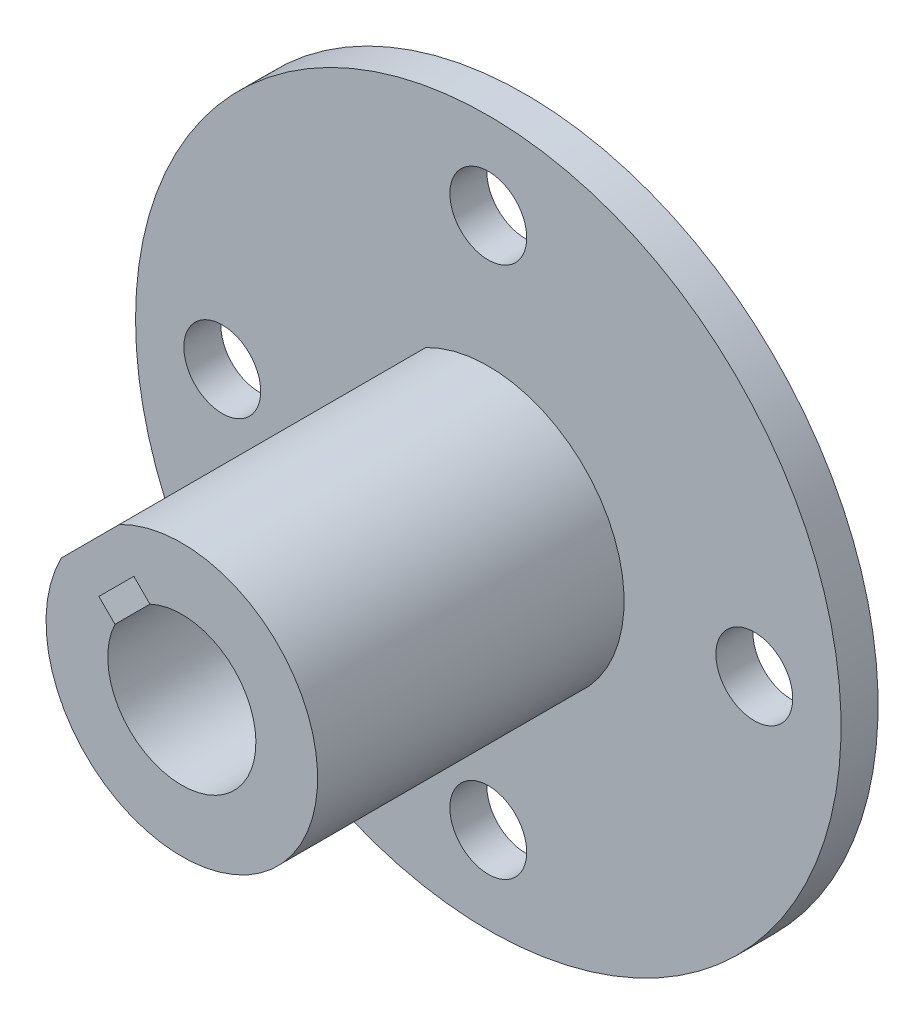
ISO-10303-21;
HEADER;
FILE_DESCRIPTION(('STEP AP214'),'2;1');
FILE_NAME('part.step','',(''),(''),'','','');
FILE_SCHEMA(('AUTOMOTIVE_DESIGN { 1 0 10303 214 1 1 1 1 }'));
ENDSEC;
DATA;
#1=APPLICATION_CONTEXT('core data for automotive mechanical design processes');
#2=APPLICATION_PROTOCOL_DEFINITION('international standard','automotive_design',2000,#1);
#3=PRODUCT_CONTEXT('',#1,'mechanical');
#4=PRODUCT('Part','Part','',(#3));
#5=PRODUCT_RELATED_PRODUCT_CATEGORY('part','',(#4));
#6=PRODUCT_DEFINITION_FORMATION('','',#4);
#7=PRODUCT_DEFINITION_CONTEXT('part definition',#1,'design');
#8=PRODUCT_DEFINITION('design','',#6,#7);
#9=PRODUCT_DEFINITION_SHAPE('','',#8);
#10=(LENGTH_UNIT() NAMED_UNIT(*) SI_UNIT(.MILLI.,.METRE.));
#11=(NAMED_UNIT(*) PLANE_ANGLE_UNIT() SI_UNIT($,.RADIAN.));
#12=(NAMED_UNIT(*) SI_UNIT($,.STERADIAN.) SOLID_ANGLE_UNIT());
#13=UNCERTAINTY_MEASURE_WITH_UNIT(LENGTH_MEASURE(1.E-05),#10,'distance_accuracy_value','');
#14=(GEOMETRIC_REPRESENTATION_CONTEXT(3) GLOBAL_UNCERTAINTY_ASSIGNED_CONTEXT((#13)) GLOBAL_UNIT_ASSIGNED_CONTEXT((#10,
#11,#12)) REPRESENTATION_CONTEXT('',''));
#15=CARTESIAN_POINT('',(0.,0.,0.));
#16=DIRECTION('',(0.,0.,1.));
#17=DIRECTION('',(1.,0.,0.));
#18=AXIS2_PLACEMENT_3D('',#15,#16,#17);
#19=CARTESIAN_POINT('',(-180.,-85.,60.));
#20=DIRECTION('',(0.,0.,-1.));
#21=DIRECTION('',(0.,-1.,0.));
#22=AXIS2_PLACEMENT_3D('',#19,#20,#21);
#23=PLANE('',#22);
#24=CARTESIAN_POINT('',(-180.,-106.5475,60.));
#25=DIRECTION('',(0.,0.,1.));
#26=DIRECTION('',(1.,0.,0.));
#27=AXIS2_PLACEMENT_3D('',#24,#25,#26);
#28=CIRCLE('',#27,3.1125);
#29=CARTESIAN_POINT('',(-183.1125,-106.5475,60.));
#30=VERTEX_POINT('',#29);
#31=EDGE_CURVE('E164',#30,#30,#28,.T.);
#32=ORIENTED_EDGE('',*,*,#31,.T.);
#33=EDGE_LOOP('',(#32));
#34=FACE_BOUND('',#33,.T.);
#35=CARTESIAN_POINT('',(-158.4525,-85.,60.));
#36=DIRECTION('',(0.,0.,1.));
#37=DIRECTION('',(1.,0.,0.));
#38=AXIS2_PLACEMENT_3D('',#35,#36,#37);
#39=CIRCLE('',#38,3.1125);
#40=CARTESIAN_POINT('',(-161.565,-85.,60.));
#41=VERTEX_POINT('',#40);
#42=EDGE_CURVE('E150',#41,#41,#39,.T.);
#43=ORIENTED_EDGE('',*,*,#42,.T.);
#44=EDGE_LOOP('',(#43));
#45=FACE_BOUND('',#44,.T.);
#46=CARTESIAN_POINT('',(-201.5475,-85.,60.));
#47=DIRECTION('',(0.,0.,1.));
#48=DIRECTION('',(1.,0.,0.));
#49=AXIS2_PLACEMENT_3D('',#46,#47,#48);
#50=CIRCLE('',#49,3.1125);
#51=CARTESIAN_POINT('',(-204.66,-85.,60.));
#52=VERTEX_POINT('',#51);
#53=EDGE_CURVE('E154',#52,#52,#50,.T.);
#54=ORIENTED_EDGE('',*,*,#53,.T.);
#55=EDGE_LOOP('',(#54));
#56=FACE_BOUND('',#55,.T.);
#57=CARTESIAN_POINT('',(-180.,-63.4525,60.));
#58=DIRECTION('',(0.,0.,1.));
#59=DIRECTION('',(1.,0.,0.));
#60=AXIS2_PLACEMENT_3D('',#57,#58,#59);
#61=CIRCLE('',#60,3.1125);
#62=CARTESIAN_POINT('',(-183.1125,-63.4525,60.));
#63=VERTEX_POINT('',#62);
#64=EDGE_CURVE('E182',#63,#63,#61,.T.);
#65=ORIENTED_EDGE('',*,*,#64,.T.);
#66=EDGE_LOOP('',(#65));
#67=FACE_BOUND('',#66,.T.);
#68=CARTESIAN_POINT('',(-180.,-85.,60.));
#69=DIRECTION('',(0.,0.,-1.));
#70=DIRECTION('',(1.,0.,0.));
#71=AXIS2_PLACEMENT_3D('',#68,#69,#70);
#72=CIRCLE('',#71,28.575);
#73=CARTESIAN_POINT('',(-208.575,-85.,60.));
#74=VERTEX_POINT('',#73);
#75=EDGE_CURVE('E23',#74,#74,#72,.T.);
#76=ORIENTED_EDGE('',*,*,#75,.T.);
#77=EDGE_LOOP('',(#76));
#78=FACE_BOUND('',#77,.T.);
#79=ADVANCED_FACE('F20',(#34,#45,#56,#67,#78),#23,.T.);
#80=CARTESIAN_POINT('',(-180.,-85.,63.));
#81=DIRECTION('',(0.,0.,-1.));
#82=DIRECTION('',(1.,0.,0.));
#83=AXIS2_PLACEMENT_3D('',#80,#81,#82);
#84=CYLINDRICAL_SURFACE('',#83,28.575);
#85=ORIENTED_EDGE('',*,*,#75,.F.);
#86=DIRECTION('',(0.,0.,1.));
#87=VECTOR('',#86,1.);
#88=CARTESIAN_POINT('',(-208.575,-85.,63.));
#89=LINE('',#88,#87);
#90=CARTESIAN_POINT('',(-208.575,-85.,63.));
#91=VERTEX_POINT('',#90);
#92=EDGE_CURVE('E12',#74,#91,#89,.T.);
#93=ORIENTED_EDGE('',*,*,#92,.T.);
#94=CARTESIAN_POINT('',(-180.,-85.,63.));
#95=DIRECTION('',(0.,0.,-1.));
#96=DIRECTION('',(1.,0.,0.));
#97=AXIS2_PLACEMENT_3D('',#94,#95,#96);
#98=CIRCLE('',#97,28.575);
#99=EDGE_CURVE('E192',#91,#91,#98,.T.);
#100=ORIENTED_EDGE('',*,*,#99,.T.);
#101=ORIENTED_EDGE('',*,*,#92,.F.);
#102=EDGE_LOOP('',(#85,#93,#100,#101));
#103=FACE_BOUND('',#102,.T.);
#104=ADVANCED_FACE('F190',(#103),#84,.T.);
#105=CARTESIAN_POINT('',(-180.,-63.4525,63.));
#106=DIRECTION('',(0.,0.,-1.));
#107=DIRECTION('',(1.,0.,0.));
#108=AXIS2_PLACEMENT_3D('',#105,#106,#107);
#109=CYLINDRICAL_SURFACE('',#108,3.1125);
#110=ORIENTED_EDGE('',*,*,#64,.F.);
#111=DIRECTION('',(0.,0.,1.));
#112=VECTOR('',#111,1.);
#113=CARTESIAN_POINT('',(-183.1125,-63.4525,63.));
#114=LINE('',#113,#112);
#115=CARTESIAN_POINT('',(-183.1125,-63.4525,63.));
#116=VERTEX_POINT('',#115);
#117=EDGE_CURVE('E53',#63,#116,#114,.T.);
#118=ORIENTED_EDGE('',*,*,#117,.T.);
#119=CARTESIAN_POINT('',(-180.,-63.4525,63.));
#120=DIRECTION('',(0.,0.,1.));
#121=DIRECTION('',(1.,0.,0.));
#122=AXIS2_PLACEMENT_3D('',#119,#120,#121);
#123=CIRCLE('',#122,3.1125);
#124=EDGE_CURVE('E195',#116,#116,#123,.T.);
#125=ORIENTED_EDGE('',*,*,#124,.T.);
#126=ORIENTED_EDGE('',*,*,#117,.F.);
#127=EDGE_LOOP('',(#110,#118,#125,#126));
#128=FACE_BOUND('',#127,.T.);
#129=ADVANCED_FACE('F270',(#128),#109,.F.);
#130=CARTESIAN_POINT('',(-201.5475,-85.,63.));
#131=DIRECTION('',(0.,0.,-1.));
#132=DIRECTION('',(1.,0.,0.));
#133=AXIS2_PLACEMENT_3D('',#130,#131,#132);
#134=CYLINDRICAL_SURFACE('',#133,3.1125);
#135=ORIENTED_EDGE('',*,*,#53,.F.);
#136=DIRECTION('',(0.,0.,1.));
#137=VECTOR('',#136,1.);
#138=CARTESIAN_POINT('',(-204.66,-85.,63.));
#139=LINE('',#138,#137);
#140=CARTESIAN_POINT('',(-204.66,-85.,63.));
#141=VERTEX_POINT('',#140);
#142=EDGE_CURVE('E180',#52,#141,#139,.T.);
#143=ORIENTED_EDGE('',*,*,#142,.T.);
#144=CARTESIAN_POINT('',(-201.5475,-85.,63.));
#145=DIRECTION('',(0.,0.,1.));
#146=DIRECTION('',(1.,0.,0.));
#147=AXIS2_PLACEMENT_3D('',#144,#145,#146);
#148=CIRCLE('',#147,3.1125);
#149=EDGE_CURVE('E201',#141,#141,#148,.T.);
#150=ORIENTED_EDGE('',*,*,#149,.T.);
#151=ORIENTED_EDGE('',*,*,#142,.F.);
#152=EDGE_LOOP('',(#135,#143,#150,#151));
#153=FACE_BOUND('',#152,.T.);
#154=ADVANCED_FACE('F475',(#153),#134,.F.);
#155=CARTESIAN_POINT('',(-158.4525,-85.,63.));
#156=DIRECTION('',(0.,0.,-1.));
#157=DIRECTION('',(1.,0.,0.));
#158=AXIS2_PLACEMENT_3D('',#155,#156,#157);
#159=CYLINDRICAL_SURFACE('',#158,3.1125);
#160=ORIENTED_EDGE('',*,*,#42,.F.);
#161=DIRECTION('',(0.,0.,1.));
#162=VECTOR('',#161,1.);
#163=CARTESIAN_POINT('',(-161.565,-85.,63.));
#164=LINE('',#163,#162);
#165=CARTESIAN_POINT('',(-161.565,-85.,63.));
#166=VERTEX_POINT('',#165);
#167=EDGE_CURVE('E147',#41,#166,#164,.T.);
#168=ORIENTED_EDGE('',*,*,#167,.T.);
#169=CARTESIAN_POINT('',(-158.4525,-85.,63.));
#170=DIRECTION('',(0.,0.,1.));
#171=DIRECTION('',(1.,0.,0.));
#172=AXIS2_PLACEMENT_3D('',#169,#170,#171);
#173=CIRCLE('',#172,3.1125);
#174=EDGE_CURVE('E152',#166,#166,#173,.T.);
#175=ORIENTED_EDGE('',*,*,#174,.T.);
#176=ORIENTED_EDGE('',*,*,#167,.F.);
#177=EDGE_LOOP('',(#160,#168,#175,#176));
#178=FACE_BOUND('',#177,.T.);
#179=ADVANCED_FACE('F149',(#178),#159,.F.);
#180=CARTESIAN_POINT('',(-180.,-106.5475,63.));
#181=DIRECTION('',(0.,0.,-1.));
#182=DIRECTION('',(1.,0.,0.));
#183=AXIS2_PLACEMENT_3D('',#180,#181,#182);
#184=CYLINDRICAL_SURFACE('',#183,3.1125);
#185=ORIENTED_EDGE('',*,*,#31,.F.);
#186=DIRECTION('',(0.,0.,1.));
#187=VECTOR('',#186,1.);
#188=CARTESIAN_POINT('',(-183.1125,-106.5475,63.));
#189=LINE('',#188,#187);
#190=CARTESIAN_POINT('',(-183.1125,-106.5475,63.));
#191=VERTEX_POINT('',#190);
#192=EDGE_CURVE('E159',#30,#191,#189,.T.);
#193=ORIENTED_EDGE('',*,*,#192,.T.);
#194=CARTESIAN_POINT('',(-180.,-106.5475,63.));
#195=DIRECTION('',(0.,0.,1.));
#196=DIRECTION('',(1.,0.,0.));
#197=AXIS2_PLACEMENT_3D('',#194,#195,#196);
#198=CIRCLE('',#197,3.1125);
#199=EDGE_CURVE('E276',#191,#191,#198,.T.);
#200=ORIENTED_EDGE('',*,*,#199,.T.);
#201=ORIENTED_EDGE('',*,*,#192,.F.);
#202=EDGE_LOOP('',(#185,#193,#200,#201));
#203=FACE_BOUND('',#202,.T.);
#204=ADVANCED_FACE('F544',(#203),#184,.F.);
#205=CARTESIAN_POINT('',(-183.363689411313,-81.6363105886868,63.));
#206=DIRECTION('',(0.,0.,-1.));
#207=DIRECTION('',(0.,-1.,0.));
#208=AXIS2_PLACEMENT_3D('',#205,#206,#207);
#209=PLANE('',#208);
#210=DIRECTION('',(0.707106781186548,-0.707106781186548,0.));
#211=VECTOR('',#210,1.);
#212=CARTESIAN_POINT('',(-185.096059239525,-82.7323702454446,63.));
#213=LINE('',#212,#211);
#214=CARTESIAN_POINT('',(-186.717516433784,-81.1109130511855,63.));
#215=VERTEX_POINT('',#214);
#216=CARTESIAN_POINT('',(-185.414214325252,-82.4142151597176,63.));
#217=VERTEX_POINT('',#216);
#218=EDGE_CURVE('E369',#215,#217,#213,.T.);
#219=ORIENTED_EDGE('',*,*,#218,.T.);
#220=CARTESIAN_POINT('',(-180.,-85.,63.));
#221=DIRECTION('',(0.,0.,1.));
#222=DIRECTION('',(0.333333065112432,0.94280913641243,0.));
#223=AXIS2_PLACEMENT_3D('',#220,#221,#222);
#224=CIRCLE('',#223,6.);
#225=CARTESIAN_POINT('',(-182.585787977923,-79.5857871732607,63.));
#226=VERTEX_POINT('',#225);
#227=EDGE_CURVE('E358',#217,#226,#224,.T.);
#228=ORIENTED_EDGE('',*,*,#227,.T.);
#229=DIRECTION('',(-0.707106781186548,0.707106781186548,0.));
#230=VECTOR('',#229,1.);
#231=CARTESIAN_POINT('',(-182.904794636203,-79.2667805149809,63.));
#232=LINE('',#231,#230);
#233=CARTESIAN_POINT('',(-183.8601122855,-78.3114628656832,63.));
#234=VERTEX_POINT('',#233);
#235=EDGE_CURVE('E329',#226,#234,#232,.T.);
#236=ORIENTED_EDGE('',*,*,#235,.T.);
#237=DIRECTION('',(1.,0.,0.));
#238=VECTOR('',#237,1.);
#239=CARTESIAN_POINT('',(-183.545945041906,-78.3114628656832,63.));
#240=LINE('',#239,#238);
#241=CARTESIAN_POINT('',(-183.728200672498,-78.3114628656832,63.));
#242=VERTEX_POINT('',#241);
#243=EDGE_CURVE('E308',#234,#242,#240,.T.);
#244=ORIENTED_EDGE('',*,*,#243,.T.);
#245=DIRECTION('',(-0.984165151344111,0.177253927685179,0.));
#246=VECTOR('',#245,1.);
#247=CARTESIAN_POINT('',(-183.342110534812,-78.380999968528,63.));
#248=LINE('',#247,#246);
#249=CARTESIAN_POINT('',(-183.889089266891,-78.2824858842925,63.));
#250=VERTEX_POINT('',#249);
#251=EDGE_CURVE('E295',#242,#250,#248,.T.);
#252=ORIENTED_EDGE('',*,*,#251,.T.);
#253=DIRECTION('',(-0.707106781186552,-0.707106781186543,0.));
#254=VECTOR('',#253,1.);
#255=CARTESIAN_POINT('',(-186.010409062542,-80.403805679943,63.));
#256=LINE('',#255,#254);
#257=EDGE_CURVE('E290',#250,#215,#256,.T.);
#258=ORIENTED_EDGE('',*,*,#257,.T.);
#259=EDGE_LOOP('',(#219,#228,#236,#244,#252,#258));
#260=FACE_BOUND('',#259,.T.);
#261=ADVANCED_FACE('F263',(#260),#209,.F.);
#262=CARTESIAN_POINT('',(-183.363689411313,-81.6363105886868,63.));
#263=DIRECTION('',(0.,0.,-1.));
#264=DIRECTION('',(0.,-1.,0.));
#265=AXIS2_PLACEMENT_3D('',#262,#263,#264);
#266=PLANE('',#265);
#267=DIRECTION('',(0.707106781186546,0.707106781186549,0.));
#268=VECTOR('',#267,1.);
#269=CARTESIAN_POINT('',(-186.235894536456,-76.4094703684508,63.));
#270=LINE('',#269,#268);
#271=CARTESIAN_POINT('',(-189.767847179096,-79.94142301109,63.));
#272=VERTEX_POINT('',#271);
#273=CARTESIAN_POINT('',(-185.05857698891,-75.2321528209044,63.));
#274=VERTEX_POINT('',#273);
#275=EDGE_CURVE('E218',#272,#274,#270,.T.);
#276=ORIENTED_EDGE('',*,*,#275,.T.);
#277=CARTESIAN_POINT('',(-180.,-85.,63.));
#278=DIRECTION('',(0.,0.,-1.));
#279=DIRECTION('',(-0.45987055997679,0.887985961638265,0.));
#280=AXIS2_PLACEMENT_3D('',#277,#278,#279);
#281=CIRCLE('',#280,11.0000018030406);
#282=EDGE_CURVE('E203',#274,#272,#281,.T.);
#283=ORIENTED_EDGE('',*,*,#282,.T.);
#284=EDGE_LOOP('',(#276,#283));
#285=FACE_BOUND('',#284,.T.);
#286=ORIENTED_EDGE('',*,*,#199,.F.);
#287=EDGE_LOOP('',(#286));
#288=FACE_BOUND('',#287,.T.);
#289=ORIENTED_EDGE('',*,*,#174,.F.);
#290=EDGE_LOOP('',(#289));
#291=FACE_BOUND('',#290,.T.);
#292=ORIENTED_EDGE('',*,*,#149,.F.);
#293=EDGE_LOOP('',(#292));
#294=FACE_BOUND('',#293,.T.);
#295=ORIENTED_EDGE('',*,*,#124,.F.);
#296=EDGE_LOOP('',(#295));
#297=FACE_BOUND('',#296,.T.);
#298=ORIENTED_EDGE('',*,*,#99,.F.);
#299=EDGE_LOOP('',(#298));
#300=FACE_BOUND('',#299,.T.);
#301=ADVANCED_FACE('F244',(#285,#288,#291,#294,#297,#300),#266,.F.);
#302=CARTESIAN_POINT('',(-214.655733916464,-85.,87.82499988));
#303=DIRECTION('',(0.,0.,-1.));
#304=DIRECTION('',(0.,-1.,0.));
#305=AXIS2_PLACEMENT_3D('',#302,#303,#304);
#306=PLANE('',#305);
#307=DIRECTION('',(0.707106781186552,0.707106781186543,0.));
#308=VECTOR('',#307,1.);
#309=CARTESIAN_POINT('',(-185.303302850338,-79.696699467739,87.82499988));
#310=LINE('',#309,#308);
#311=CARTESIAN_POINT('',(-186.717516433784,-81.1109130511855,87.82499988));
#312=VERTEX_POINT('',#311);
#313=CARTESIAN_POINT('',(-183.889089266891,-78.2824858842925,87.82499988));
#314=VERTEX_POINT('',#313);
#315=EDGE_CURVE('E225',#312,#314,#310,.T.);
#316=ORIENTED_EDGE('',*,*,#315,.T.);
#317=DIRECTION('',(0.984165151344111,-0.177253927685179,0.));
#318=VECTOR('',#317,1.);
#319=CARTESIAN_POINT('',(-183.889089266891,-78.2824858842925,87.82499988));
#320=LINE('',#319,#318);
#321=CARTESIAN_POINT('',(-183.728200672498,-78.3114628656832,87.82499988));
#322=VERTEX_POINT('',#321);
#323=EDGE_CURVE('E300',#314,#322,#320,.T.);
#324=ORIENTED_EDGE('',*,*,#323,.T.);
#325=DIRECTION('',(-1.,0.,0.));
#326=VECTOR('',#325,1.);
#327=CARTESIAN_POINT('',(-183.918066248282,-78.3114628656832,87.82499988));
#328=LINE('',#327,#326);
#329=CARTESIAN_POINT('',(-183.8601122855,-78.3114628656832,87.82499988));
#330=VERTEX_POINT('',#329);
#331=EDGE_CURVE('E313',#322,#330,#328,.T.);
#332=ORIENTED_EDGE('',*,*,#331,.T.);
#333=DIRECTION('',(0.707106781186548,-0.707106781186548,0.));
#334=VECTOR('',#333,1.);
#335=CARTESIAN_POINT('',(-183.889089266891,-78.2824858842925,87.82499988));
#336=LINE('',#335,#334);
#337=CARTESIAN_POINT('',(-182.585787977923,-79.5857871732607,87.82499988));
#338=VERTEX_POINT('',#337);
#339=EDGE_CURVE('E334',#330,#338,#336,.T.);
#340=ORIENTED_EDGE('',*,*,#339,.T.);
#341=CARTESIAN_POINT('',(-180.,-85.,87.82499988));
#342=DIRECTION('',(0.,0.,-1.));
#343=DIRECTION('',(0.333333065112432,0.94280913641243,0.));
#344=AXIS2_PLACEMENT_3D('',#341,#342,#343);
#345=CIRCLE('',#344,6.);
#346=CARTESIAN_POINT('',(-185.414214325252,-82.4142151597176,87.82499988));
#347=VERTEX_POINT('',#346);
#348=EDGE_CURVE('E343',#338,#347,#345,.T.);
#349=ORIENTED_EDGE('',*,*,#348,.T.);
#350=DIRECTION('',(-0.707106781186548,0.707106781186548,0.));
#351=VECTOR('',#350,1.);
#352=CARTESIAN_POINT('',(-186.717516433784,-81.1109130511855,87.82499988));
#353=LINE('',#352,#351);
#354=EDGE_CURVE('E364',#347,#312,#353,.T.);
#355=ORIENTED_EDGE('',*,*,#354,.T.);
#356=EDGE_LOOP('',(#316,#324,#332,#340,#349,#355));
#357=FACE_BOUND('',#356,.T.);
#358=CARTESIAN_POINT('',(-180.,-85.,87.82499988));
#359=DIRECTION('',(0.,0.,1.));
#360=DIRECTION('',(-0.45987055997679,0.887985961638265,0.));
#361=AXIS2_PLACEMENT_3D('',#358,#359,#360);
#362=CIRCLE('',#361,11.0000018030406);
#363=CARTESIAN_POINT('',(-189.767847179096,-79.94142301109,87.82499988));
#364=VERTEX_POINT('',#363);
#365=CARTESIAN_POINT('',(-185.05857698891,-75.2321528209044,87.82499988));
#366=VERTEX_POINT('',#365);
#367=EDGE_CURVE('E196',#364,#366,#362,.T.);
#368=ORIENTED_EDGE('',*,*,#367,.T.);
#369=DIRECTION('',(-0.707106781186546,-0.707106781186549,0.));
#370=VECTOR('',#369,1.);
#371=CARTESIAN_POINT('',(-185.05857698891,-75.2321528209044,87.82499988));
#372=LINE('',#371,#370);
#373=EDGE_CURVE('E231',#366,#364,#372,.T.);
#374=ORIENTED_EDGE('',*,*,#373,.T.);
#375=EDGE_LOOP('',(#368,#374));
#376=FACE_BOUND('',#375,.T.);
#377=ADVANCED_FACE('F254',(#357,#376),#306,.F.);
#378=CARTESIAN_POINT('',(-180.,-85.,63.));
#379=DIRECTION('',(0.,0.,1.));
#380=DIRECTION('',(0.707106781186548,-0.707106781186547,0.));
#381=AXIS2_PLACEMENT_3D('',#378,#379,#380);
#382=CYLINDRICAL_SURFACE('',#381,11.0000018030406);
#383=ORIENTED_EDGE('',*,*,#282,.F.);
#384=DIRECTION('',(0.,0.,1.));
#385=VECTOR('',#384,1.);
#386=CARTESIAN_POINT('',(-185.05857698891,-75.2321528209044,63.));
#387=LINE('',#386,#385);
#388=EDGE_CURVE('E235',#274,#366,#387,.T.);
#389=ORIENTED_EDGE('',*,*,#388,.T.);
#390=ORIENTED_EDGE('',*,*,#367,.F.);
#391=DIRECTION('',(0.,0.,1.));
#392=VECTOR('',#391,1.);
#393=CARTESIAN_POINT('',(-189.767847179096,-79.94142301109,63.));
#394=LINE('',#393,#392);
#395=EDGE_CURVE('E224',#272,#364,#394,.T.);
#396=ORIENTED_EDGE('',*,*,#395,.F.);
#397=EDGE_LOOP('',(#383,#389,#390,#396));
#398=FACE_BOUND('',#397,.T.);
#399=ADVANCED_FACE('F249',(#398),#382,.T.);
#400=CARTESIAN_POINT('',(-185.05857698891,-75.2321528209044,63.));
#401=DIRECTION('',(-0.707106781186549,0.707106781186546,0.));
#402=DIRECTION('',(0.,0.,1.));
#403=AXIS2_PLACEMENT_3D('',#400,#401,#402);
#404=PLANE('',#403);
#405=ORIENTED_EDGE('',*,*,#275,.F.);
#406=ORIENTED_EDGE('',*,*,#395,.T.);
#407=ORIENTED_EDGE('',*,*,#373,.F.);
#408=ORIENTED_EDGE('',*,*,#388,.F.);
#409=EDGE_LOOP('',(#405,#406,#407,#408));
#410=FACE_BOUND('',#409,.T.);
#411=ADVANCED_FACE('F252',(#410),#404,.T.);
#412=CARTESIAN_POINT('',(-186.717516433784,-81.1109130511855,63.));
#413=DIRECTION('',(0.707106781186543,-0.707106781186552,0.));
#414=DIRECTION('',(0.,0.,-1.));
#415=AXIS2_PLACEMENT_3D('',#412,#413,#414);
#416=PLANE('',#415);
#417=ORIENTED_EDGE('',*,*,#257,.F.);
#418=DIRECTION('',(0.,0.,1.));
#419=VECTOR('',#418,1.);
#420=CARTESIAN_POINT('',(-183.889089266891,-78.2824858842925,63.));
#421=LINE('',#420,#419);
#422=EDGE_CURVE('E294',#250,#314,#421,.T.);
#423=ORIENTED_EDGE('',*,*,#422,.T.);
#424=ORIENTED_EDGE('',*,*,#315,.F.);
#425=DIRECTION('',(0.,0.,1.));
#426=VECTOR('',#425,1.);
#427=CARTESIAN_POINT('',(-186.717516433784,-81.1109130511855,63.));
#428=LINE('',#427,#426);
#429=EDGE_CURVE('E373',#215,#312,#428,.T.);
#430=ORIENTED_EDGE('',*,*,#429,.F.);
#431=EDGE_LOOP('',(#417,#423,#424,#430));
#432=FACE_BOUND('',#431,.T.);
#433=ADVANCED_FACE('F384',(#432),#416,.T.);
#434=CARTESIAN_POINT('',(-183.889089266891,-78.2824858842925,63.));
#435=DIRECTION('',(-0.177253927685179,-0.984165151344111,0.));
#436=DIRECTION('',(-0.984165151344111,0.177253927685179,0.));
#437=AXIS2_PLACEMENT_3D('',#434,#435,#436);
#438=PLANE('',#437);
#439=ORIENTED_EDGE('',*,*,#251,.F.);
#440=DIRECTION('',(0.,0.,1.));
#441=VECTOR('',#440,1.);
#442=CARTESIAN_POINT('',(-183.728200672498,-78.3114628656832,63.));
#443=LINE('',#442,#441);
#444=EDGE_CURVE('E301',#242,#322,#443,.T.);
#445=ORIENTED_EDGE('',*,*,#444,.T.);
#446=ORIENTED_EDGE('',*,*,#323,.F.);
#447=ORIENTED_EDGE('',*,*,#422,.F.);
#448=EDGE_LOOP('',(#439,#445,#446,#447));
#449=FACE_BOUND('',#448,.T.);
#450=ADVANCED_FACE('F463',(#449),#438,.T.);
#451=CARTESIAN_POINT('',(-183.728200672498,-78.3114628656832,63.));
#452=DIRECTION('',(0.,1.,0.));
#453=DIRECTION('',(1.,0.,0.));
#454=AXIS2_PLACEMENT_3D('',#451,#452,#453);
#455=PLANE('',#454);
#456=ORIENTED_EDGE('',*,*,#243,.F.);
#457=DIRECTION('',(0.,0.,1.));
#458=VECTOR('',#457,1.);
#459=CARTESIAN_POINT('',(-183.8601122855,-78.3114628656832,63.));
#460=LINE('',#459,#458);
#461=EDGE_CURVE('E314',#234,#330,#460,.T.);
#462=ORIENTED_EDGE('',*,*,#461,.T.);
#463=ORIENTED_EDGE('',*,*,#331,.F.);
#464=ORIENTED_EDGE('',*,*,#444,.F.);
#465=EDGE_LOOP('',(#456,#462,#463,#464));
#466=FACE_BOUND('',#465,.T.);
#467=ADVANCED_FACE('F465',(#466),#455,.T.);
#468=CARTESIAN_POINT('',(-183.8601122855,-78.3114628656832,63.));
#469=DIRECTION('',(-0.707106781186548,-0.707106781186548,0.));
#470=DIRECTION('',(-0.707106781186548,0.707106781186548,0.));
#471=AXIS2_PLACEMENT_3D('',#468,#469,#470);
#472=PLANE('',#471);
#473=ORIENTED_EDGE('',*,*,#235,.F.);
#474=DIRECTION('',(0.,0.,1.));
#475=VECTOR('',#474,1.);
#476=CARTESIAN_POINT('',(-182.585787977923,-79.5857871732607,63.));
#477=LINE('',#476,#475);
#478=EDGE_CURVE('E327',#226,#338,#477,.T.);
#479=ORIENTED_EDGE('',*,*,#478,.T.);
#480=ORIENTED_EDGE('',*,*,#339,.F.);
#481=ORIENTED_EDGE('',*,*,#461,.F.);
#482=EDGE_LOOP('',(#473,#479,#480,#481));
#483=FACE_BOUND('',#482,.T.);
#484=ADVANCED_FACE('F349',(#483),#472,.T.);
#485=CARTESIAN_POINT('',(-180.,-85.,63.));
#486=DIRECTION('',(0.,0.,1.));
#487=DIRECTION('',(0.707106986077486,-0.70710657629555,0.));
#488=AXIS2_PLACEMENT_3D('',#485,#486,#487);
#489=CYLINDRICAL_SURFACE('',#488,6.);
#490=ORIENTED_EDGE('',*,*,#227,.F.);
#491=DIRECTION('',(0.,0.,1.));
#492=VECTOR('',#491,1.);
#493=CARTESIAN_POINT('',(-185.414214325252,-82.4142151597176,63.));
#494=LINE('',#493,#492);
#495=EDGE_CURVE('E355',#217,#347,#494,.T.);
#496=ORIENTED_EDGE('',*,*,#495,.T.);
#497=ORIENTED_EDGE('',*,*,#348,.F.);
#498=ORIENTED_EDGE('',*,*,#478,.F.);
#499=EDGE_LOOP('',(#490,#496,#497,#498));
#500=FACE_BOUND('',#499,.T.);
#501=ADVANCED_FACE('F353',(#500),#489,.F.);
#502=CARTESIAN_POINT('',(-185.414214325252,-82.4142151597176,63.));
#503=DIRECTION('',(0.707106781186548,0.707106781186548,0.));
#504=DIRECTION('',(0.,0.,-1.));
#505=AXIS2_PLACEMENT_3D('',#502,#503,#504);
#506=PLANE('',#505);
#507=ORIENTED_EDGE('',*,*,#218,.F.);
#508=ORIENTED_EDGE('',*,*,#429,.T.);
#509=ORIENTED_EDGE('',*,*,#354,.F.);
#510=ORIENTED_EDGE('',*,*,#495,.F.);
#511=EDGE_LOOP('',(#507,#508,#509,#510));
#512=FACE_BOUND('',#511,.T.);
#513=ADVANCED_FACE('F382',(#512),#506,.T.);
#514=CLOSED_SHELL('',(#79,#104,#129,#154,#179,#204,#261,#301,#377,#399,#411,#433,#450,#467,#484,
#501,#513));
#515=MANIFOLD_SOLID_BREP('B1',#514);
#516=ADVANCED_BREP_SHAPE_REPRESENTATION('',(#18,#515),#14);
#517=SHAPE_DEFINITION_REPRESENTATION(#9,#516);
ENDSEC;
END-ISO-10303-21;
